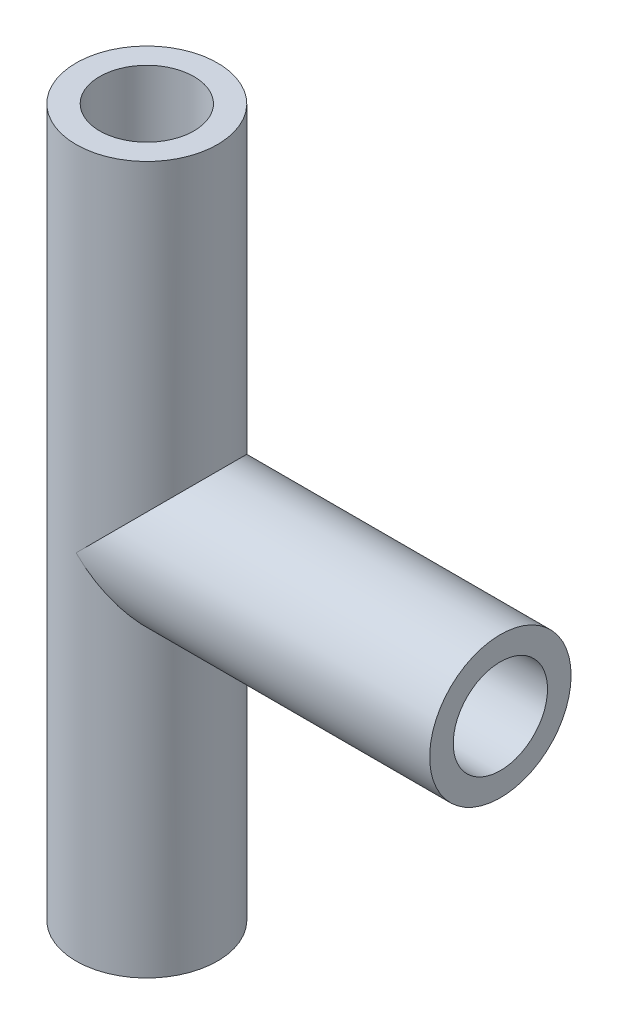
ISO-10303-21;
HEADER;
FILE_DESCRIPTION(('STEP AP214'),'2;1');
FILE_NAME('part.step','',(''),(''),'','','');
FILE_SCHEMA(('AUTOMOTIVE_DESIGN { 1 0 10303 214 1 1 1 1 }'));
ENDSEC;
DATA;
#1=APPLICATION_CONTEXT('core data for automotive mechanical design processes');
#2=APPLICATION_PROTOCOL_DEFINITION('international standard','automotive_design',2000,#1);
#3=PRODUCT_CONTEXT('',#1,'mechanical');
#4=PRODUCT('Part','Part','',(#3));
#5=PRODUCT_RELATED_PRODUCT_CATEGORY('part','',(#4));
#6=PRODUCT_DEFINITION_FORMATION('','',#4);
#7=PRODUCT_DEFINITION_CONTEXT('part definition',#1,'design');
#8=PRODUCT_DEFINITION('design','',#6,#7);
#9=PRODUCT_DEFINITION_SHAPE('','',#8);
#10=(LENGTH_UNIT() NAMED_UNIT(*) SI_UNIT(.MILLI.,.METRE.));
#11=(NAMED_UNIT(*) PLANE_ANGLE_UNIT() SI_UNIT($,.RADIAN.));
#12=(NAMED_UNIT(*) SI_UNIT($,.STERADIAN.) SOLID_ANGLE_UNIT());
#13=UNCERTAINTY_MEASURE_WITH_UNIT(LENGTH_MEASURE(1.E-05),#10,'distance_accuracy_value','');
#14=(GEOMETRIC_REPRESENTATION_CONTEXT(3) GLOBAL_UNCERTAINTY_ASSIGNED_CONTEXT((#13)) GLOBAL_UNIT_ASSIGNED_CONTEXT((#10,
#11,#12)) REPRESENTATION_CONTEXT('',''));
#15=CARTESIAN_POINT('',(0.,0.,0.));
#16=DIRECTION('',(0.,0.,1.));
#17=DIRECTION('',(1.,0.,0.));
#18=AXIS2_PLACEMENT_3D('',#15,#16,#17);
#19=CARTESIAN_POINT('',(0.,-15.,0.));
#20=DIRECTION('',(0.,1.,0.));
#21=DIRECTION('',(0.,0.,1.));
#22=AXIS2_PLACEMENT_3D('',#19,#20,#21);
#23=CYLINDRICAL_SURFACE('',#22,3.);
#24=CARTESIAN_POINT('',(0.,-15.,0.));
#25=DIRECTION('',(0.,1.,0.));
#26=DIRECTION('',(0.,0.,1.));
#27=AXIS2_PLACEMENT_3D('',#24,#25,#26);
#28=CIRCLE('',#27,3.);
#29=CARTESIAN_POINT('',(0.,-15.,3.));
#30=VERTEX_POINT('',#29);
#31=EDGE_CURVE('E85',#30,#30,#28,.T.);
#32=ORIENTED_EDGE('',*,*,#31,.T.);
#33=EDGE_LOOP('',(#32));
#34=FACE_BOUND('',#33,.T.);
#35=CARTESIAN_POINT('',(0.,15.,0.));
#36=DIRECTION('',(0.,1.,0.));
#37=DIRECTION('',(0.,0.,1.));
#38=AXIS2_PLACEMENT_3D('',#35,#36,#37);
#39=CIRCLE('',#38,3.);
#40=CARTESIAN_POINT('',(0.,15.,3.));
#41=VERTEX_POINT('',#40);
#42=EDGE_CURVE('E82',#41,#41,#39,.T.);
#43=ORIENTED_EDGE('',*,*,#42,.F.);
#44=EDGE_LOOP('',(#43));
#45=FACE_BOUND('',#44,.T.);
#46=CARTESIAN_POINT('',(0.,0.,0.));
#47=DIRECTION('',(0.707106781186547,0.707106781186547,0.));
#48=DIRECTION('',(-0.707106781186547,0.707106781186547,0.));
#49=AXIS2_PLACEMENT_3D('',#46,#47,#48);
#50=ELLIPSE('',#49,4.24264068711929,3.);
#51=CARTESIAN_POINT('',(0.,0.,-3.));
#52=VERTEX_POINT('',#51);
#53=CARTESIAN_POINT('',(0.,0.,3.));
#54=VERTEX_POINT('',#53);
#55=EDGE_CURVE('E88',#52,#54,#50,.F.);
#56=ORIENTED_EDGE('',*,*,#55,.T.);
#57=CARTESIAN_POINT('',(0.,0.,0.));
#58=DIRECTION('',(-0.707106781186547,0.707106781186547,0.));
#59=DIRECTION('',(0.707106781186547,0.707106781186547,0.));
#60=AXIS2_PLACEMENT_3D('',#57,#58,#59);
#61=ELLIPSE('',#60,4.24264068711929,3.);
#62=EDGE_CURVE('E53',#54,#52,#61,.T.);
#63=ORIENTED_EDGE('',*,*,#62,.T.);
#64=EDGE_LOOP('',(#56,#63));
#65=FACE_BOUND('',#64,.T.);
#66=ADVANCED_FACE('F35',(#34,#45,#65),#23,.T.);
#67=CARTESIAN_POINT('',(0.,-15.,0.));
#68=DIRECTION('',(0.,1.,0.));
#69=DIRECTION('',(0.,0.,1.));
#70=AXIS2_PLACEMENT_3D('',#67,#68,#69);
#71=PLANE('',#70);
#72=CARTESIAN_POINT('',(0.,-15.,0.));
#73=DIRECTION('',(0.,-1.,0.));
#74=DIRECTION('',(0.,0.,-1.));
#75=AXIS2_PLACEMENT_3D('',#72,#73,#74);
#76=CIRCLE('',#75,2.);
#77=CARTESIAN_POINT('',(0.,-15.,-2.));
#78=VERTEX_POINT('',#77);
#79=EDGE_CURVE('E71',#78,#78,#76,.T.);
#80=ORIENTED_EDGE('',*,*,#79,.F.);
#81=EDGE_LOOP('',(#80));
#82=FACE_BOUND('',#81,.T.);
#83=ORIENTED_EDGE('',*,*,#31,.F.);
#84=EDGE_LOOP('',(#83));
#85=FACE_BOUND('',#84,.T.);
#86=ADVANCED_FACE('F105',(#82,#85),#71,.F.);
#87=CARTESIAN_POINT('',(0.,15.,0.));
#88=DIRECTION('',(0.,1.,0.));
#89=DIRECTION('',(0.,0.,1.));
#90=AXIS2_PLACEMENT_3D('',#87,#88,#89);
#91=PLANE('',#90);
#92=CARTESIAN_POINT('',(0.,15.,0.));
#93=DIRECTION('',(0.,-1.,0.));
#94=DIRECTION('',(0.,0.,-1.));
#95=AXIS2_PLACEMENT_3D('',#92,#93,#94);
#96=CIRCLE('',#95,2.);
#97=CARTESIAN_POINT('',(0.,15.,-2.));
#98=VERTEX_POINT('',#97);
#99=EDGE_CURVE('E68',#98,#98,#96,.T.);
#100=ORIENTED_EDGE('',*,*,#99,.T.);
#101=EDGE_LOOP('',(#100));
#102=FACE_BOUND('',#101,.T.);
#103=ORIENTED_EDGE('',*,*,#42,.T.);
#104=EDGE_LOOP('',(#103));
#105=FACE_BOUND('',#104,.T.);
#106=ADVANCED_FACE('F94',(#102,#105),#91,.T.);
#107=CARTESIAN_POINT('',(15.,0.,0.));
#108=DIRECTION('',(-1.,0.,0.));
#109=DIRECTION('',(0.,0.,1.));
#110=AXIS2_PLACEMENT_3D('',#107,#108,#109);
#111=CYLINDRICAL_SURFACE('',#110,3.);
#112=ORIENTED_EDGE('',*,*,#62,.F.);
#113=ORIENTED_EDGE('',*,*,#55,.F.);
#114=EDGE_LOOP('',(#112,#113));
#115=FACE_BOUND('',#114,.T.);
#116=CARTESIAN_POINT('',(15.,0.,0.));
#117=DIRECTION('',(1.,0.,0.));
#118=DIRECTION('',(0.,0.,-1.));
#119=AXIS2_PLACEMENT_3D('',#116,#117,#118);
#120=CIRCLE('',#119,3.);
#121=CARTESIAN_POINT('',(15.,0.,-3.));
#122=VERTEX_POINT('',#121);
#123=EDGE_CURVE('E75',#122,#122,#120,.T.);
#124=ORIENTED_EDGE('',*,*,#123,.F.);
#125=EDGE_LOOP('',(#124));
#126=FACE_BOUND('',#125,.T.);
#127=ADVANCED_FACE('F91',(#115,#126),#111,.T.);
#128=CARTESIAN_POINT('',(15.,0.,0.));
#129=DIRECTION('',(1.,0.,0.));
#130=DIRECTION('',(0.,0.,-1.));
#131=AXIS2_PLACEMENT_3D('',#128,#129,#130);
#132=PLANE('',#131);
#133=CARTESIAN_POINT('',(15.,0.,0.));
#134=DIRECTION('',(1.,0.,0.));
#135=DIRECTION('',(0.,0.,-1.));
#136=AXIS2_PLACEMENT_3D('',#133,#134,#135);
#137=CIRCLE('',#136,2.);
#138=CARTESIAN_POINT('',(15.,0.,-2.));
#139=VERTEX_POINT('',#138);
#140=EDGE_CURVE('E73',#139,#139,#137,.T.);
#141=ORIENTED_EDGE('',*,*,#140,.F.);
#142=EDGE_LOOP('',(#141));
#143=FACE_BOUND('',#142,.T.);
#144=ORIENTED_EDGE('',*,*,#123,.T.);
#145=EDGE_LOOP('',(#144));
#146=FACE_BOUND('',#145,.T.);
#147=ADVANCED_FACE('F63',(#143,#146),#132,.T.);
#148=CARTESIAN_POINT('',(0.,15.,0.));
#149=DIRECTION('',(0.,-1.,0.));
#150=DIRECTION('',(0.,0.,-1.));
#151=AXIS2_PLACEMENT_3D('',#148,#149,#150);
#152=CYLINDRICAL_SURFACE('',#151,2.);
#153=CARTESIAN_POINT('',(0.,0.,0.));
#154=DIRECTION('',(-0.707106781186547,-0.707106781186547,0.));
#155=DIRECTION('',(0.707106781186547,-0.707106781186547,0.));
#156=AXIS2_PLACEMENT_3D('',#153,#154,#155);
#157=ELLIPSE('',#156,2.82842712474619,2.);
#158=CARTESIAN_POINT('',(0.,0.,2.));
#159=VERTEX_POINT('',#158);
#160=CARTESIAN_POINT('',(0.,0.,-2.));
#161=VERTEX_POINT('',#160);
#162=EDGE_CURVE('E42',#159,#161,#157,.F.);
#163=ORIENTED_EDGE('',*,*,#162,.T.);
#164=CARTESIAN_POINT('',(0.,0.,0.));
#165=DIRECTION('',(0.707106781186547,-0.707106781186547,0.));
#166=DIRECTION('',(-0.707106781186547,-0.707106781186547,0.));
#167=AXIS2_PLACEMENT_3D('',#164,#165,#166);
#168=ELLIPSE('',#167,2.82842712474619,2.);
#169=EDGE_CURVE('E11',#161,#159,#168,.T.);
#170=ORIENTED_EDGE('',*,*,#169,.T.);
#171=EDGE_LOOP('',(#163,#170));
#172=FACE_BOUND('',#171,.T.);
#173=ORIENTED_EDGE('',*,*,#99,.F.);
#174=EDGE_LOOP('',(#173));
#175=FACE_BOUND('',#174,.T.);
#176=ORIENTED_EDGE('',*,*,#79,.T.);
#177=EDGE_LOOP('',(#176));
#178=FACE_BOUND('',#177,.T.);
#179=ADVANCED_FACE('F60',(#172,#175,#178),#152,.F.);
#180=CARTESIAN_POINT('',(0.,0.,0.));
#181=DIRECTION('',(1.,0.,0.));
#182=DIRECTION('',(0.,0.,-1.));
#183=AXIS2_PLACEMENT_3D('',#180,#181,#182);
#184=CYLINDRICAL_SURFACE('',#183,2.);
#185=ORIENTED_EDGE('',*,*,#140,.T.);
#186=EDGE_LOOP('',(#185));
#187=FACE_BOUND('',#186,.T.);
#188=ORIENTED_EDGE('',*,*,#162,.F.);
#189=ORIENTED_EDGE('',*,*,#169,.F.);
#190=EDGE_LOOP('',(#188,#189));
#191=FACE_BOUND('',#190,.T.);
#192=ADVANCED_FACE('F58',(#187,#191),#184,.F.);
#193=CLOSED_SHELL('',(#66,#86,#106,#127,#147,#179,#192));
#194=MANIFOLD_SOLID_BREP('B2',#193);
#195=ADVANCED_BREP_SHAPE_REPRESENTATION('',(#18,#194),#14);
#196=SHAPE_DEFINITION_REPRESENTATION(#9,#195);
ENDSEC;
END-ISO-10303-21;
